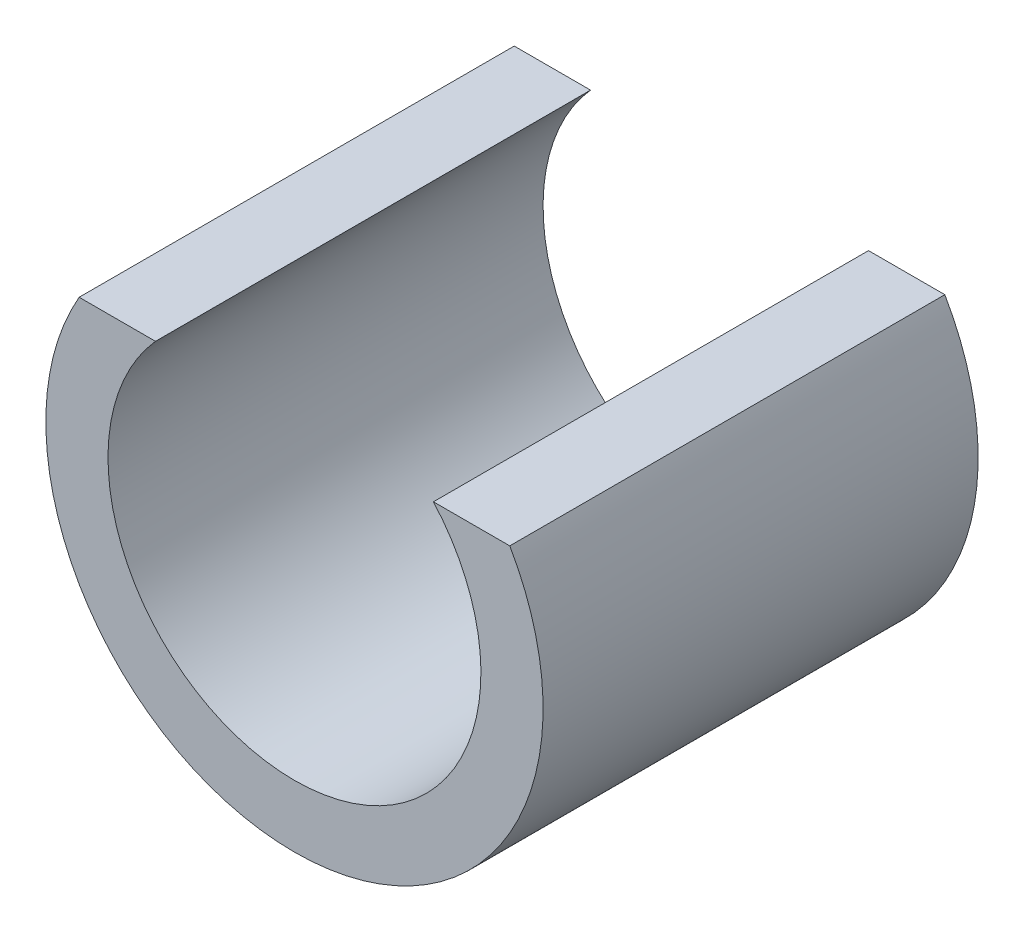
ISO-10303-21;
HEADER;
FILE_DESCRIPTION(('STEP AP214'),'2;1');
FILE_NAME('part.step','',(''),(''),'','','');
FILE_SCHEMA(('AUTOMOTIVE_DESIGN { 1 0 10303 214 1 1 1 1 }'));
ENDSEC;
DATA;
#1=APPLICATION_CONTEXT('core data for automotive mechanical design processes');
#2=APPLICATION_PROTOCOL_DEFINITION('international standard','automotive_design',2000,#1);
#3=PRODUCT_CONTEXT('',#1,'mechanical');
#4=PRODUCT('Part','Part','',(#3));
#5=PRODUCT_RELATED_PRODUCT_CATEGORY('part','',(#4));
#6=PRODUCT_DEFINITION_FORMATION('','',#4);
#7=PRODUCT_DEFINITION_CONTEXT('part definition',#1,'design');
#8=PRODUCT_DEFINITION('design','',#6,#7);
#9=PRODUCT_DEFINITION_SHAPE('','',#8);
#10=(LENGTH_UNIT() NAMED_UNIT(*) SI_UNIT(.MILLI.,.METRE.));
#11=(NAMED_UNIT(*) PLANE_ANGLE_UNIT() SI_UNIT($,.RADIAN.));
#12=(NAMED_UNIT(*) SI_UNIT($,.STERADIAN.) SOLID_ANGLE_UNIT());
#13=UNCERTAINTY_MEASURE_WITH_UNIT(LENGTH_MEASURE(1.E-05),#10,'distance_accuracy_value','');
#14=(GEOMETRIC_REPRESENTATION_CONTEXT(3) GLOBAL_UNCERTAINTY_ASSIGNED_CONTEXT((#13)) GLOBAL_UNIT_ASSIGNED_CONTEXT((#10,
#11,#12)) REPRESENTATION_CONTEXT('',''));
#15=CARTESIAN_POINT('',(0.,0.,0.));
#16=DIRECTION('',(0.,0.,1.));
#17=DIRECTION('',(1.,0.,0.));
#18=AXIS2_PLACEMENT_3D('',#15,#16,#17);
#19=CARTESIAN_POINT('',(0.,1.,3.5));
#20=DIRECTION('',(0.,1.,0.));
#21=DIRECTION('',(-1.,0.,0.));
#22=AXIS2_PLACEMENT_3D('',#19,#20,#21);
#23=PLANE('',#22);
#24=DIRECTION('',(1.,0.,0.));
#25=VECTOR('',#24,1.);
#26=CARTESIAN_POINT('',(0.,1.,0.));
#27=LINE('',#26,#25);
#28=CARTESIAN_POINT('',(-1.73205080756888,1.,0.));
#29=VERTEX_POINT('',#28);
#30=CARTESIAN_POINT('',(-1.1180339887499,1.,0.));
#31=VERTEX_POINT('',#30);
#32=EDGE_CURVE('E108',#29,#31,#27,.T.);
#33=ORIENTED_EDGE('',*,*,#32,.F.);
#34=DIRECTION('',(0.,0.,-1.));
#35=VECTOR('',#34,1.);
#36=CARTESIAN_POINT('',(-1.73205080756888,1.,3.5));
#37=LINE('',#36,#35);
#38=CARTESIAN_POINT('',(-1.73205080756888,1.,3.5));
#39=VERTEX_POINT('',#38);
#40=EDGE_CURVE('E11',#39,#29,#37,.T.);
#41=ORIENTED_EDGE('',*,*,#40,.F.);
#42=DIRECTION('',(1.,0.,0.));
#43=VECTOR('',#42,1.);
#44=CARTESIAN_POINT('',(0.,1.,3.5));
#45=LINE('',#44,#43);
#46=CARTESIAN_POINT('',(-1.1180339887499,1.,3.5));
#47=VERTEX_POINT('',#46);
#48=EDGE_CURVE('E90',#39,#47,#45,.T.);
#49=ORIENTED_EDGE('',*,*,#48,.T.);
#50=DIRECTION('',(0.,0.,-1.));
#51=VECTOR('',#50,1.);
#52=CARTESIAN_POINT('',(-1.1180339887499,1.,3.5));
#53=LINE('',#52,#51);
#54=EDGE_CURVE('E58',#47,#31,#53,.T.);
#55=ORIENTED_EDGE('',*,*,#54,.T.);
#56=EDGE_LOOP('',(#33,#41,#49,#55));
#57=FACE_BOUND('',#56,.T.);
#58=ADVANCED_FACE('F41',(#57),#23,.T.);
#59=CARTESIAN_POINT('',(0.,0.,3.5));
#60=DIRECTION('',(0.,0.,-1.));
#61=DIRECTION('',(-1.,0.,0.));
#62=AXIS2_PLACEMENT_3D('',#59,#60,#61);
#63=CYLINDRICAL_SURFACE('',#62,2.);
#64=CARTESIAN_POINT('',(0.,0.,0.));
#65=DIRECTION('',(0.,0.,1.));
#66=DIRECTION('',(1.,0.,0.));
#67=AXIS2_PLACEMENT_3D('',#64,#65,#66);
#68=CIRCLE('',#67,2.);
#69=CARTESIAN_POINT('',(1.73205080756888,1.,0.));
#70=VERTEX_POINT('',#69);
#71=EDGE_CURVE('E95',#29,#70,#68,.T.);
#72=ORIENTED_EDGE('',*,*,#71,.T.);
#73=DIRECTION('',(0.,0.,-1.));
#74=VECTOR('',#73,1.);
#75=CARTESIAN_POINT('',(1.73205080756888,1.,3.5));
#76=LINE('',#75,#74);
#77=CARTESIAN_POINT('',(1.73205080756888,1.,3.5));
#78=VERTEX_POINT('',#77);
#79=EDGE_CURVE('E50',#78,#70,#76,.T.);
#80=ORIENTED_EDGE('',*,*,#79,.F.);
#81=CARTESIAN_POINT('',(0.,0.,3.5));
#82=DIRECTION('',(0.,0.,1.));
#83=DIRECTION('',(1.,0.,0.));
#84=AXIS2_PLACEMENT_3D('',#81,#82,#83);
#85=CIRCLE('',#84,2.);
#86=EDGE_CURVE('E84',#39,#78,#85,.T.);
#87=ORIENTED_EDGE('',*,*,#86,.F.);
#88=ORIENTED_EDGE('',*,*,#40,.T.);
#89=EDGE_LOOP('',(#72,#80,#87,#88));
#90=FACE_BOUND('',#89,.T.);
#91=ADVANCED_FACE('F43',(#90),#63,.T.);
#92=CARTESIAN_POINT('',(1.1180339887499,1.,0.));
#93=VERTEX_POINT('',#92);
#94=EDGE_CURVE('E104',#93,#70,#27,.T.);
#95=ORIENTED_EDGE('',*,*,#94,.F.);
#96=DIRECTION('',(0.,0.,-1.));
#97=VECTOR('',#96,1.);
#98=CARTESIAN_POINT('',(1.1180339887499,1.,3.5));
#99=LINE('',#98,#97);
#100=CARTESIAN_POINT('',(1.1180339887499,1.,3.5));
#101=VERTEX_POINT('',#100);
#102=EDGE_CURVE('E71',#101,#93,#99,.T.);
#103=ORIENTED_EDGE('',*,*,#102,.F.);
#104=EDGE_CURVE('E89',#101,#78,#45,.T.);
#105=ORIENTED_EDGE('',*,*,#104,.T.);
#106=ORIENTED_EDGE('',*,*,#79,.T.);
#107=EDGE_LOOP('',(#95,#103,#105,#106));
#108=FACE_BOUND('',#107,.T.);
#109=ADVANCED_FACE('F98',(#108),#23,.T.);
#110=CARTESIAN_POINT('',(0.,0.,3.5));
#111=DIRECTION('',(0.,0.,-1.));
#112=DIRECTION('',(-1.,0.,0.));
#113=AXIS2_PLACEMENT_3D('',#110,#111,#112);
#114=CYLINDRICAL_SURFACE('',#113,1.5);
#115=CARTESIAN_POINT('',(0.,0.,0.));
#116=DIRECTION('',(0.,0.,1.));
#117=DIRECTION('',(1.,0.,0.));
#118=AXIS2_PLACEMENT_3D('',#115,#116,#117);
#119=CIRCLE('',#118,1.5);
#120=EDGE_CURVE('E102',#31,#93,#119,.T.);
#121=ORIENTED_EDGE('',*,*,#120,.F.);
#122=ORIENTED_EDGE('',*,*,#54,.F.);
#123=CARTESIAN_POINT('',(0.,0.,3.5));
#124=DIRECTION('',(0.,0.,1.));
#125=DIRECTION('',(1.,0.,0.));
#126=AXIS2_PLACEMENT_3D('',#123,#124,#125);
#127=CIRCLE('',#126,1.5);
#128=EDGE_CURVE('E99',#47,#101,#127,.T.);
#129=ORIENTED_EDGE('',*,*,#128,.T.);
#130=ORIENTED_EDGE('',*,*,#102,.T.);
#131=EDGE_LOOP('',(#121,#122,#129,#130));
#132=FACE_BOUND('',#131,.T.);
#133=ADVANCED_FACE('F113',(#132),#114,.F.);
#134=CARTESIAN_POINT('',(0.,0.,3.5));
#135=DIRECTION('',(0.,0.,1.));
#136=DIRECTION('',(1.,0.,0.));
#137=AXIS2_PLACEMENT_3D('',#134,#135,#136);
#138=PLANE('',#137);
#139=ORIENTED_EDGE('',*,*,#48,.F.);
#140=ORIENTED_EDGE('',*,*,#86,.T.);
#141=ORIENTED_EDGE('',*,*,#104,.F.);
#142=ORIENTED_EDGE('',*,*,#128,.F.);
#143=EDGE_LOOP('',(#139,#140,#141,#142));
#144=FACE_BOUND('',#143,.T.);
#145=ADVANCED_FACE('F86',(#144),#138,.T.);
#146=CARTESIAN_POINT('',(0.,0.,0.));
#147=DIRECTION('',(0.,0.,1.));
#148=DIRECTION('',(1.,0.,0.));
#149=AXIS2_PLACEMENT_3D('',#146,#147,#148);
#150=PLANE('',#149);
#151=ORIENTED_EDGE('',*,*,#32,.T.);
#152=ORIENTED_EDGE('',*,*,#120,.T.);
#153=ORIENTED_EDGE('',*,*,#94,.T.);
#154=ORIENTED_EDGE('',*,*,#71,.F.);
#155=EDGE_LOOP('',(#151,#152,#153,#154));
#156=FACE_BOUND('',#155,.T.);
#157=ADVANCED_FACE('F112',(#156),#150,.F.);
#158=CLOSED_SHELL('',(#58,#91,#109,#133,#145,#157));
#159=MANIFOLD_SOLID_BREP('B2',#158);
#160=ADVANCED_BREP_SHAPE_REPRESENTATION('',(#18,#159),#14);
#161=SHAPE_DEFINITION_REPRESENTATION(#9,#160);
ENDSEC;
END-ISO-10303-21;
